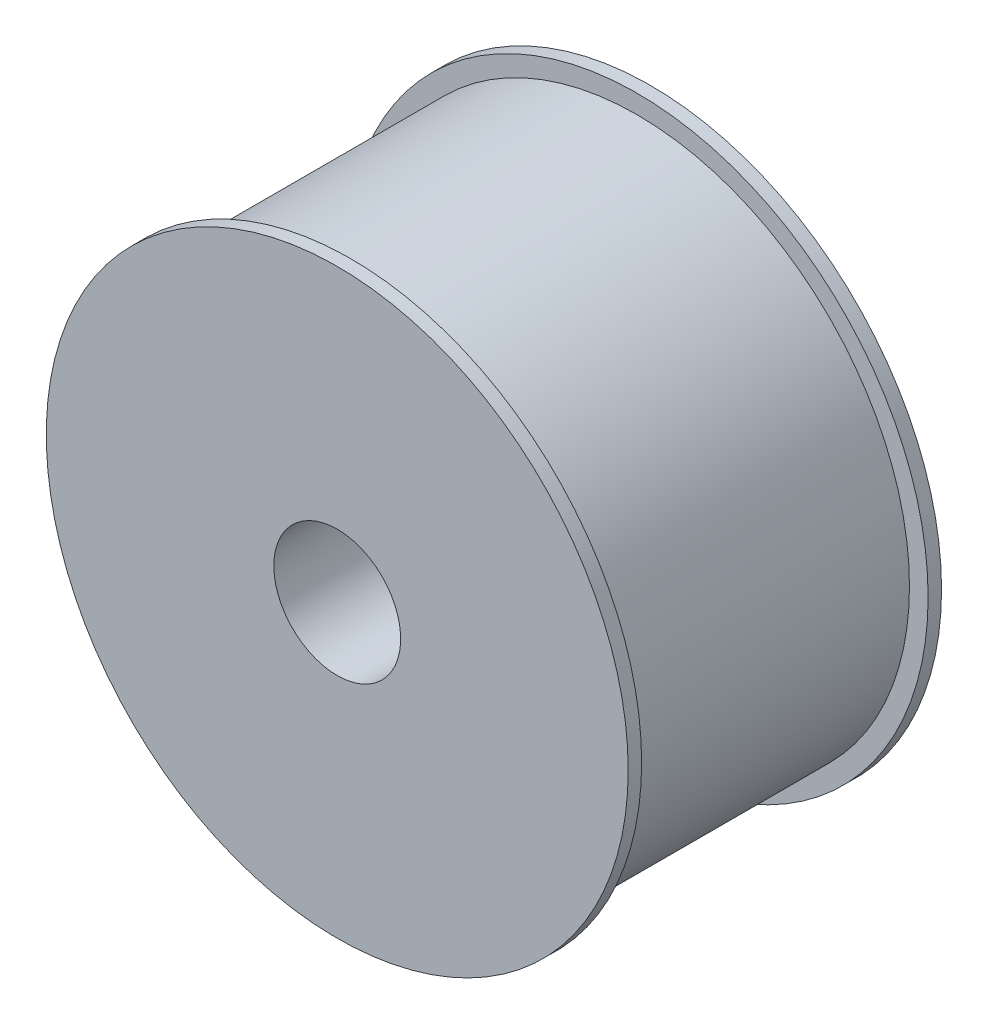
ISO-10303-21;
HEADER;
FILE_DESCRIPTION(('STEP AP214'),'2;1');
FILE_NAME('part.step','',(''),(''),'','','');
FILE_SCHEMA(('AUTOMOTIVE_DESIGN { 1 0 10303 214 1 1 1 1 }'));
ENDSEC;
DATA;
#1=APPLICATION_CONTEXT('core data for automotive mechanical design processes');
#2=APPLICATION_PROTOCOL_DEFINITION('international standard','automotive_design',2000,#1);
#3=PRODUCT_CONTEXT('',#1,'mechanical');
#4=PRODUCT('Part','Part','',(#3));
#5=PRODUCT_RELATED_PRODUCT_CATEGORY('part','',(#4));
#6=PRODUCT_DEFINITION_FORMATION('','',#4);
#7=PRODUCT_DEFINITION_CONTEXT('part definition',#1,'design');
#8=PRODUCT_DEFINITION('design','',#6,#7);
#9=PRODUCT_DEFINITION_SHAPE('','',#8);
#10=(LENGTH_UNIT() NAMED_UNIT(*) SI_UNIT(.MILLI.,.METRE.));
#11=(NAMED_UNIT(*) PLANE_ANGLE_UNIT() SI_UNIT($,.RADIAN.));
#12=(NAMED_UNIT(*) SI_UNIT($,.STERADIAN.) SOLID_ANGLE_UNIT());
#13=UNCERTAINTY_MEASURE_WITH_UNIT(LENGTH_MEASURE(1.E-05),#10,'distance_accuracy_value','');
#14=(GEOMETRIC_REPRESENTATION_CONTEXT(3) GLOBAL_UNCERTAINTY_ASSIGNED_CONTEXT((#13)) GLOBAL_UNIT_ASSIGNED_CONTEXT((#10,
#11,#12)) REPRESENTATION_CONTEXT('',''));
#15=CARTESIAN_POINT('',(0.,0.,0.));
#16=DIRECTION('',(0.,0.,1.));
#17=DIRECTION('',(1.,0.,0.));
#18=AXIS2_PLACEMENT_3D('',#15,#16,#17);
#19=CARTESIAN_POINT('',(0.,0.,38.4));
#20=DIRECTION('',(0.,0.,-1.));
#21=DIRECTION('',(-1.,0.,0.));
#22=AXIS2_PLACEMENT_3D('',#19,#20,#21);
#23=CYLINDRICAL_SURFACE('',#22,36.5);
#24=CARTESIAN_POINT('',(0.,0.,38.4));
#25=DIRECTION('',(0.,0.,1.));
#26=DIRECTION('',(1.,0.,0.));
#27=AXIS2_PLACEMENT_3D('',#24,#25,#26);
#28=CIRCLE('',#27,36.5);
#29=CARTESIAN_POINT('',(36.5,0.,38.4));
#30=VERTEX_POINT('',#29);
#31=EDGE_CURVE('E10',#30,#30,#28,.T.);
#32=ORIENTED_EDGE('',*,*,#31,.F.);
#33=EDGE_LOOP('',(#32));
#34=FACE_BOUND('',#33,.T.);
#35=CARTESIAN_POINT('',(0.,0.,0.));
#36=DIRECTION('',(0.,0.,1.));
#37=DIRECTION('',(1.,0.,0.));
#38=AXIS2_PLACEMENT_3D('',#35,#36,#37);
#39=CIRCLE('',#38,36.5);
#40=CARTESIAN_POINT('',(36.5,0.,0.));
#41=VERTEX_POINT('',#40);
#42=EDGE_CURVE('E40',#41,#41,#39,.T.);
#43=ORIENTED_EDGE('',*,*,#42,.T.);
#44=EDGE_LOOP('',(#43));
#45=FACE_BOUND('',#44,.T.);
#46=ADVANCED_FACE('F37',(#34,#45),#23,.T.);
#47=CARTESIAN_POINT('',(0.,0.,40.2));
#48=DIRECTION('',(0.,0.,-1.));
#49=DIRECTION('',(-1.,0.,0.));
#50=AXIS2_PLACEMENT_3D('',#47,#48,#49);
#51=CYLINDRICAL_SURFACE('',#50,39.);
#52=CARTESIAN_POINT('',(0.,0.,40.2));
#53=DIRECTION('',(0.,0.,1.));
#54=DIRECTION('',(1.,0.,0.));
#55=AXIS2_PLACEMENT_3D('',#52,#53,#54);
#56=CIRCLE('',#55,39.);
#57=CARTESIAN_POINT('',(39.,0.,40.2));
#58=VERTEX_POINT('',#57);
#59=EDGE_CURVE('E45',#58,#58,#56,.T.);
#60=ORIENTED_EDGE('',*,*,#59,.F.);
#61=EDGE_LOOP('',(#60));
#62=FACE_BOUND('',#61,.T.);
#63=CARTESIAN_POINT('',(0.,0.,38.4));
#64=DIRECTION('',(0.,0.,1.));
#65=DIRECTION('',(1.,0.,0.));
#66=AXIS2_PLACEMENT_3D('',#63,#64,#65);
#67=CIRCLE('',#66,39.);
#68=CARTESIAN_POINT('',(39.,0.,38.4));
#69=VERTEX_POINT('',#68);
#70=EDGE_CURVE('E50',#69,#69,#67,.T.);
#71=ORIENTED_EDGE('',*,*,#70,.T.);
#72=EDGE_LOOP('',(#71));
#73=FACE_BOUND('',#72,.T.);
#74=ADVANCED_FACE('F103',(#62,#73),#51,.T.);
#75=CARTESIAN_POINT('',(0.,0.,40.2));
#76=DIRECTION('',(0.,0.,1.));
#77=DIRECTION('',(1.,0.,0.));
#78=AXIS2_PLACEMENT_3D('',#75,#76,#77);
#79=PLANE('',#78);
#80=CARTESIAN_POINT('',(0.,0.,40.2));
#81=DIRECTION('',(0.,0.,-1.));
#82=DIRECTION('',(-1.,0.,0.));
#83=AXIS2_PLACEMENT_3D('',#80,#81,#82);
#84=CIRCLE('',#83,8.5);
#85=CARTESIAN_POINT('',(-8.5,0.,40.2));
#86=VERTEX_POINT('',#85);
#87=EDGE_CURVE('E61',#86,#86,#84,.T.);
#88=ORIENTED_EDGE('',*,*,#87,.T.);
#89=EDGE_LOOP('',(#88));
#90=FACE_BOUND('',#89,.T.);
#91=ORIENTED_EDGE('',*,*,#59,.T.);
#92=EDGE_LOOP('',(#91));
#93=FACE_BOUND('',#92,.T.);
#94=ADVANCED_FACE('F73',(#90,#93),#79,.T.);
#95=CARTESIAN_POINT('',(0.,0.,38.4));
#96=DIRECTION('',(0.,0.,1.));
#97=DIRECTION('',(1.,0.,0.));
#98=AXIS2_PLACEMENT_3D('',#95,#96,#97);
#99=PLANE('',#98);
#100=ORIENTED_EDGE('',*,*,#31,.T.);
#101=EDGE_LOOP('',(#100));
#102=FACE_BOUND('',#101,.T.);
#103=ORIENTED_EDGE('',*,*,#70,.F.);
#104=EDGE_LOOP('',(#103));
#105=FACE_BOUND('',#104,.T.);
#106=ADVANCED_FACE('F92',(#102,#105),#99,.F.);
#107=CARTESIAN_POINT('',(0.,0.,-1.8));
#108=DIRECTION('',(0.,0.,1.));
#109=DIRECTION('',(1.,0.,0.));
#110=AXIS2_PLACEMENT_3D('',#107,#108,#109);
#111=CYLINDRICAL_SURFACE('',#110,39.);
#112=CARTESIAN_POINT('',(0.,0.,-1.8));
#113=DIRECTION('',(0.,0.,1.));
#114=DIRECTION('',(1.,0.,0.));
#115=AXIS2_PLACEMENT_3D('',#112,#113,#114);
#116=CIRCLE('',#115,39.);
#117=CARTESIAN_POINT('',(39.,0.,-1.8));
#118=VERTEX_POINT('',#117);
#119=EDGE_CURVE('E60',#118,#118,#116,.T.);
#120=ORIENTED_EDGE('',*,*,#119,.T.);
#121=EDGE_LOOP('',(#120));
#122=FACE_BOUND('',#121,.T.);
#123=CARTESIAN_POINT('',(0.,0.,0.));
#124=DIRECTION('',(0.,0.,1.));
#125=DIRECTION('',(1.,0.,0.));
#126=AXIS2_PLACEMENT_3D('',#123,#124,#125);
#127=CIRCLE('',#126,39.);
#128=CARTESIAN_POINT('',(39.,0.,0.));
#129=VERTEX_POINT('',#128);
#130=EDGE_CURVE('E56',#129,#129,#127,.T.);
#131=ORIENTED_EDGE('',*,*,#130,.F.);
#132=EDGE_LOOP('',(#131));
#133=FACE_BOUND('',#132,.T.);
#134=ADVANCED_FACE('F86',(#122,#133),#111,.T.);
#135=CARTESIAN_POINT('',(0.,0.,-1.8));
#136=DIRECTION('',(0.,0.,-1.));
#137=DIRECTION('',(1.,0.,0.));
#138=AXIS2_PLACEMENT_3D('',#135,#136,#137);
#139=PLANE('',#138);
#140=CARTESIAN_POINT('',(0.,0.,-1.8));
#141=DIRECTION('',(0.,0.,-1.));
#142=DIRECTION('',(-1.,0.,0.));
#143=AXIS2_PLACEMENT_3D('',#140,#141,#142);
#144=CIRCLE('',#143,8.5);
#145=CARTESIAN_POINT('',(-8.5,0.,-1.8));
#146=VERTEX_POINT('',#145);
#147=EDGE_CURVE('E65',#146,#146,#144,.T.);
#148=ORIENTED_EDGE('',*,*,#147,.F.);
#149=EDGE_LOOP('',(#148));
#150=FACE_BOUND('',#149,.T.);
#151=ORIENTED_EDGE('',*,*,#119,.F.);
#152=EDGE_LOOP('',(#151));
#153=FACE_BOUND('',#152,.T.);
#154=ADVANCED_FACE('F83',(#150,#153),#139,.T.);
#155=CARTESIAN_POINT('',(0.,0.,0.));
#156=DIRECTION('',(0.,0.,-1.));
#157=DIRECTION('',(1.,0.,0.));
#158=AXIS2_PLACEMENT_3D('',#155,#156,#157);
#159=PLANE('',#158);
#160=ORIENTED_EDGE('',*,*,#42,.F.);
#161=EDGE_LOOP('',(#160));
#162=FACE_BOUND('',#161,.T.);
#163=ORIENTED_EDGE('',*,*,#130,.T.);
#164=EDGE_LOOP('',(#163));
#165=FACE_BOUND('',#164,.T.);
#166=ADVANCED_FACE('F79',(#162,#165),#159,.F.);
#167=CARTESIAN_POINT('',(0.,0.,40.2));
#168=DIRECTION('',(0.,0.,-1.));
#169=DIRECTION('',(-1.,0.,0.));
#170=AXIS2_PLACEMENT_3D('',#167,#168,#169);
#171=CYLINDRICAL_SURFACE('',#170,8.5);
#172=ORIENTED_EDGE('',*,*,#87,.F.);
#173=EDGE_LOOP('',(#172));
#174=FACE_BOUND('',#173,.T.);
#175=ORIENTED_EDGE('',*,*,#147,.T.);
#176=EDGE_LOOP('',(#175));
#177=FACE_BOUND('',#176,.T.);
#178=ADVANCED_FACE('F76',(#174,#177),#171,.F.);
#179=CLOSED_SHELL('',(#46,#74,#94,#106,#134,#154,#166,#178));
#180=MANIFOLD_SOLID_BREP('B2',#179);
#181=ADVANCED_BREP_SHAPE_REPRESENTATION('',(#18,#180),#14);
#182=SHAPE_DEFINITION_REPRESENTATION(#9,#181);
ENDSEC;
END-ISO-10303-21;
